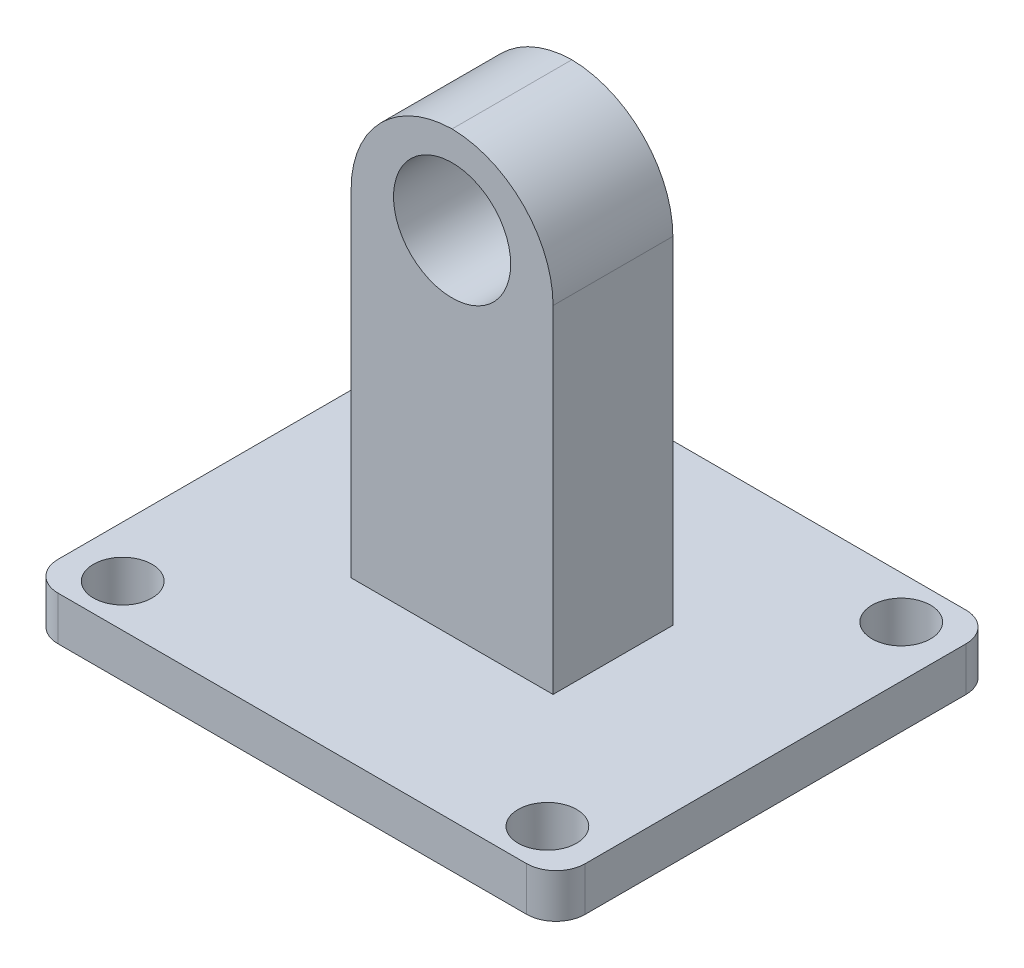
ISO-10303-21;
HEADER;
FILE_DESCRIPTION(('STEP AP214'),'2;1');
FILE_NAME('part.step','',(''),(''),'','','');
FILE_SCHEMA(('AUTOMOTIVE_DESIGN { 1 0 10303 214 1 1 1 1 }'));
ENDSEC;
DATA;
#1=APPLICATION_CONTEXT('core data for automotive mechanical design processes');
#2=APPLICATION_PROTOCOL_DEFINITION('international standard','automotive_design',2000,#1);
#3=PRODUCT_CONTEXT('',#1,'mechanical');
#4=PRODUCT('Part','Part','',(#3));
#5=PRODUCT_RELATED_PRODUCT_CATEGORY('part','',(#4));
#6=PRODUCT_DEFINITION_FORMATION('','',#4);
#7=PRODUCT_DEFINITION_CONTEXT('part definition',#1,'design');
#8=PRODUCT_DEFINITION('design','',#6,#7);
#9=PRODUCT_DEFINITION_SHAPE('','',#8);
#10=(LENGTH_UNIT() NAMED_UNIT(*) SI_UNIT(.MILLI.,.METRE.));
#11=(NAMED_UNIT(*) PLANE_ANGLE_UNIT() SI_UNIT($,.RADIAN.));
#12=(NAMED_UNIT(*) SI_UNIT($,.STERADIAN.) SOLID_ANGLE_UNIT());
#13=UNCERTAINTY_MEASURE_WITH_UNIT(LENGTH_MEASURE(1.E-05),#10,'distance_accuracy_value','');
#14=(GEOMETRIC_REPRESENTATION_CONTEXT(3) GLOBAL_UNCERTAINTY_ASSIGNED_CONTEXT((#13)) GLOBAL_UNIT_ASSIGNED_CONTEXT((#10,
#11,#12)) REPRESENTATION_CONTEXT('',''));
#15=CARTESIAN_POINT('',(0.,0.,0.));
#16=DIRECTION('',(0.,0.,1.));
#17=DIRECTION('',(1.,0.,0.));
#18=AXIS2_PLACEMENT_3D('',#15,#16,#17);
#19=CARTESIAN_POINT('',(0.,3.,0.));
#20=DIRECTION('',(0.,-1.,0.));
#21=DIRECTION('',(0.,0.,-1.));
#22=AXIS2_PLACEMENT_3D('',#19,#20,#21);
#23=PLANE('',#22);
#24=CARTESIAN_POINT('',(-14.5,3.,-12.0833333333333));
#25=DIRECTION('',(0.,-1.,0.));
#26=DIRECTION('',(0.,0.,-1.));
#27=AXIS2_PLACEMENT_3D('',#24,#25,#26);
#28=CIRCLE('',#27,2.);
#29=CARTESIAN_POINT('',(-14.5,3.,-14.0833333333333));
#30=VERTEX_POINT('',#29);
#31=EDGE_CURVE('E401',#30,#30,#28,.F.);
#32=ORIENTED_EDGE('',*,*,#31,.F.);
#33=EDGE_LOOP('',(#32));
#34=FACE_BOUND('',#33,.T.);
#35=CARTESIAN_POINT('',(-14.5,3.,12.0833333333333));
#36=DIRECTION('',(0.,-1.,0.));
#37=DIRECTION('',(0.,0.,-1.));
#38=AXIS2_PLACEMENT_3D('',#35,#36,#37);
#39=CIRCLE('',#38,2.);
#40=CARTESIAN_POINT('',(-14.5,3.,10.0833333333333));
#41=VERTEX_POINT('',#40);
#42=EDGE_CURVE('E405',#41,#41,#39,.F.);
#43=ORIENTED_EDGE('',*,*,#42,.F.);
#44=EDGE_LOOP('',(#43));
#45=FACE_BOUND('',#44,.T.);
#46=CARTESIAN_POINT('',(14.5,3.,12.0833333333333));
#47=DIRECTION('',(0.,-1.,0.));
#48=DIRECTION('',(0.,0.,-1.));
#49=AXIS2_PLACEMENT_3D('',#46,#47,#48);
#50=CIRCLE('',#49,2.);
#51=CARTESIAN_POINT('',(14.5,3.,10.0833333333333));
#52=VERTEX_POINT('',#51);
#53=EDGE_CURVE('E414',#52,#52,#50,.F.);
#54=ORIENTED_EDGE('',*,*,#53,.F.);
#55=EDGE_LOOP('',(#54));
#56=FACE_BOUND('',#55,.T.);
#57=CARTESIAN_POINT('',(14.5,3.,-12.0833333333333));
#58=DIRECTION('',(0.,-1.,0.));
#59=DIRECTION('',(0.,0.,-1.));
#60=AXIS2_PLACEMENT_3D('',#57,#58,#59);
#61=CIRCLE('',#60,2.);
#62=CARTESIAN_POINT('',(14.5,3.,-14.0833333333333));
#63=VERTEX_POINT('',#62);
#64=EDGE_CURVE('E237',#63,#63,#61,.F.);
#65=ORIENTED_EDGE('',*,*,#64,.F.);
#66=EDGE_LOOP('',(#65));
#67=FACE_BOUND('',#66,.T.);
#68=DIRECTION('',(0.,0.,-1.));
#69=VECTOR('',#68,1.);
#70=CARTESIAN_POINT('',(-18.,3.,15.));
#71=LINE('',#70,#69);
#72=CARTESIAN_POINT('',(-18.,3.,13.));
#73=VERTEX_POINT('',#72);
#74=CARTESIAN_POINT('',(-18.,3.,-13.));
#75=VERTEX_POINT('',#74);
#76=EDGE_CURVE('E155',#73,#75,#71,.T.);
#77=ORIENTED_EDGE('',*,*,#76,.F.);
#78=CARTESIAN_POINT('',(-16.,3.,13.));
#79=DIRECTION('',(0.,-1.,0.));
#80=DIRECTION('',(0.,0.,-1.));
#81=AXIS2_PLACEMENT_3D('',#78,#79,#80);
#82=CIRCLE('',#81,2.);
#83=CARTESIAN_POINT('',(-16.,3.,15.));
#84=VERTEX_POINT('',#83);
#85=EDGE_CURVE('E202',#73,#84,#82,.F.);
#86=ORIENTED_EDGE('',*,*,#85,.T.);
#87=DIRECTION('',(1.,0.,0.));
#88=VECTOR('',#87,1.);
#89=CARTESIAN_POINT('',(-18.,3.,15.));
#90=LINE('',#89,#88);
#91=CARTESIAN_POINT('',(16.,3.,15.));
#92=VERTEX_POINT('',#91);
#93=EDGE_CURVE('E165',#84,#92,#90,.T.);
#94=ORIENTED_EDGE('',*,*,#93,.T.);
#95=CARTESIAN_POINT('',(16.,3.,13.));
#96=DIRECTION('',(0.,-1.,0.));
#97=DIRECTION('',(0.,0.,-1.));
#98=AXIS2_PLACEMENT_3D('',#95,#96,#97);
#99=CIRCLE('',#98,2.);
#100=CARTESIAN_POINT('',(18.,3.,13.));
#101=VERTEX_POINT('',#100);
#102=EDGE_CURVE('E196',#92,#101,#99,.F.);
#103=ORIENTED_EDGE('',*,*,#102,.T.);
#104=DIRECTION('',(0.,0.,-1.));
#105=VECTOR('',#104,1.);
#106=CARTESIAN_POINT('',(18.,3.,15.));
#107=LINE('',#106,#105);
#108=CARTESIAN_POINT('',(18.,3.,-13.));
#109=VERTEX_POINT('',#108);
#110=EDGE_CURVE('E162',#101,#109,#107,.T.);
#111=ORIENTED_EDGE('',*,*,#110,.T.);
#112=CARTESIAN_POINT('',(16.,3.,-13.));
#113=DIRECTION('',(0.,-1.,0.));
#114=DIRECTION('',(0.,0.,-1.));
#115=AXIS2_PLACEMENT_3D('',#112,#113,#114);
#116=CIRCLE('',#115,2.);
#117=CARTESIAN_POINT('',(16.,3.,-15.));
#118=VERTEX_POINT('',#117);
#119=EDGE_CURVE('E198',#109,#118,#116,.F.);
#120=ORIENTED_EDGE('',*,*,#119,.T.);
#121=DIRECTION('',(1.,0.,0.));
#122=VECTOR('',#121,1.);
#123=CARTESIAN_POINT('',(-18.,3.,-15.));
#124=LINE('',#123,#122);
#125=CARTESIAN_POINT('',(-16.,3.,-15.));
#126=VERTEX_POINT('',#125);
#127=EDGE_CURVE('E158',#126,#118,#124,.T.);
#128=ORIENTED_EDGE('',*,*,#127,.F.);
#129=CARTESIAN_POINT('',(-16.,3.,-13.));
#130=DIRECTION('',(0.,-1.,0.));
#131=DIRECTION('',(0.,0.,-1.));
#132=AXIS2_PLACEMENT_3D('',#129,#130,#131);
#133=CIRCLE('',#132,2.);
#134=EDGE_CURVE('E200',#126,#75,#133,.F.);
#135=ORIENTED_EDGE('',*,*,#134,.T.);
#136=EDGE_LOOP('',(#77,#86,#94,#103,#111,#120,#128,#135));
#137=FACE_BOUND('',#136,.T.);
#138=DIRECTION('',(0.,0.,-1.));
#139=VECTOR('',#138,1.);
#140=CARTESIAN_POINT('',(6.89465133886415,3.,4.09048344357987));
#141=LINE('',#140,#139);
#142=CARTESIAN_POINT('',(6.89465133886415,3.,4.09048344357987));
#143=VERTEX_POINT('',#142);
#144=CARTESIAN_POINT('',(6.89465133886415,3.,-4.09048344357987));
#145=VERTEX_POINT('',#144);
#146=EDGE_CURVE('E128',#143,#145,#141,.T.);
#147=ORIENTED_EDGE('',*,*,#146,.F.);
#148=DIRECTION('',(1.,0.,0.));
#149=VECTOR('',#148,1.);
#150=CARTESIAN_POINT('',(-6.89465133886415,3.,4.09048344357987));
#151=LINE('',#150,#149);
#152=CARTESIAN_POINT('',(-6.89465133886415,3.,4.09048344357987));
#153=VERTEX_POINT('',#152);
#154=EDGE_CURVE('E133',#153,#143,#151,.T.);
#155=ORIENTED_EDGE('',*,*,#154,.F.);
#156=DIRECTION('',(0.,0.,1.));
#157=VECTOR('',#156,1.);
#158=CARTESIAN_POINT('',(-6.89465133886415,3.,4.09048344357987));
#159=LINE('',#158,#157);
#160=CARTESIAN_POINT('',(-6.89465133886415,3.,-4.09048344357987));
#161=VERTEX_POINT('',#160);
#162=EDGE_CURVE('E144',#161,#153,#159,.T.);
#163=ORIENTED_EDGE('',*,*,#162,.F.);
#164=DIRECTION('',(-1.,0.,0.));
#165=VECTOR('',#164,1.);
#166=CARTESIAN_POINT('',(-6.89465133886415,3.,-4.09048344357987));
#167=LINE('',#166,#165);
#168=EDGE_CURVE('E141',#145,#161,#167,.T.);
#169=ORIENTED_EDGE('',*,*,#168,.F.);
#170=EDGE_LOOP('',(#147,#155,#163,#169));
#171=FACE_BOUND('',#170,.T.);
#172=ADVANCED_FACE('F32',(#34,#45,#56,#67,#137,#171),#23,.F.);
#173=CARTESIAN_POINT('',(-18.,3.,15.));
#174=DIRECTION('',(-1.,0.,0.));
#175=DIRECTION('',(0.,0.,1.));
#176=AXIS2_PLACEMENT_3D('',#173,#174,#175);
#177=PLANE('',#176);
#178=DIRECTION('',(0.,0.,-1.));
#179=VECTOR('',#178,1.);
#180=CARTESIAN_POINT('',(-18.,0.,15.));
#181=LINE('',#180,#179);
#182=CARTESIAN_POINT('',(-18.,0.,13.));
#183=VERTEX_POINT('',#182);
#184=CARTESIAN_POINT('',(-18.,0.,-13.));
#185=VERTEX_POINT('',#184);
#186=EDGE_CURVE('E154',#183,#185,#181,.T.);
#187=ORIENTED_EDGE('',*,*,#186,.F.);
#188=DIRECTION('',(0.,-1.,0.));
#189=VECTOR('',#188,1.);
#190=CARTESIAN_POINT('',(-18.,3.,13.));
#191=LINE('',#190,#189);
#192=EDGE_CURVE('E194',#183,#73,#191,.F.);
#193=ORIENTED_EDGE('',*,*,#192,.T.);
#194=ORIENTED_EDGE('',*,*,#76,.T.);
#195=DIRECTION('',(0.,-1.,0.));
#196=VECTOR('',#195,1.);
#197=CARTESIAN_POINT('',(-18.,3.,-13.));
#198=LINE('',#197,#196);
#199=EDGE_CURVE('E191',#75,#185,#198,.T.);
#200=ORIENTED_EDGE('',*,*,#199,.T.);
#201=EDGE_LOOP('',(#187,#193,#194,#200));
#202=FACE_BOUND('',#201,.T.);
#203=ADVANCED_FACE('F254',(#202),#177,.T.);
#204=CARTESIAN_POINT('',(-18.,3.,15.));
#205=DIRECTION('',(0.,0.,-1.));
#206=DIRECTION('',(-1.,0.,0.));
#207=AXIS2_PLACEMENT_3D('',#204,#205,#206);
#208=PLANE('',#207);
#209=ORIENTED_EDGE('',*,*,#93,.F.);
#210=DIRECTION('',(0.,-1.,0.));
#211=VECTOR('',#210,1.);
#212=CARTESIAN_POINT('',(-16.,0.,15.));
#213=LINE('',#212,#211);
#214=CARTESIAN_POINT('',(-16.,0.,15.));
#215=VERTEX_POINT('',#214);
#216=EDGE_CURVE('E180',#84,#215,#213,.T.);
#217=ORIENTED_EDGE('',*,*,#216,.T.);
#218=DIRECTION('',(1.,0.,0.));
#219=VECTOR('',#218,1.);
#220=CARTESIAN_POINT('',(-18.,0.,15.));
#221=LINE('',#220,#219);
#222=CARTESIAN_POINT('',(16.,0.,15.));
#223=VERTEX_POINT('',#222);
#224=EDGE_CURVE('E159',#215,#223,#221,.T.);
#225=ORIENTED_EDGE('',*,*,#224,.T.);
#226=DIRECTION('',(0.,-1.,0.));
#227=VECTOR('',#226,1.);
#228=CARTESIAN_POINT('',(16.,3.,15.));
#229=LINE('',#228,#227);
#230=EDGE_CURVE('E168',#223,#92,#229,.F.);
#231=ORIENTED_EDGE('',*,*,#230,.T.);
#232=EDGE_LOOP('',(#209,#217,#225,#231));
#233=FACE_BOUND('',#232,.T.);
#234=ADVANCED_FACE('F260',(#233),#208,.F.);
#235=CARTESIAN_POINT('',(18.,3.,15.));
#236=DIRECTION('',(-1.,0.,0.));
#237=DIRECTION('',(0.,0.,1.));
#238=AXIS2_PLACEMENT_3D('',#235,#236,#237);
#239=PLANE('',#238);
#240=DIRECTION('',(0.,0.,-1.));
#241=VECTOR('',#240,1.);
#242=CARTESIAN_POINT('',(18.,0.,15.));
#243=LINE('',#242,#241);
#244=CARTESIAN_POINT('',(18.,0.,13.));
#245=VERTEX_POINT('',#244);
#246=CARTESIAN_POINT('',(18.,0.,-13.));
#247=VERTEX_POINT('',#246);
#248=EDGE_CURVE('E174',#245,#247,#243,.T.);
#249=ORIENTED_EDGE('',*,*,#248,.T.);
#250=DIRECTION('',(0.,-1.,0.));
#251=VECTOR('',#250,1.);
#252=CARTESIAN_POINT('',(18.,3.,-13.));
#253=LINE('',#252,#251);
#254=EDGE_CURVE('E212',#247,#109,#253,.F.);
#255=ORIENTED_EDGE('',*,*,#254,.T.);
#256=ORIENTED_EDGE('',*,*,#110,.F.);
#257=DIRECTION('',(0.,-1.,0.));
#258=VECTOR('',#257,1.);
#259=CARTESIAN_POINT('',(18.,3.,13.));
#260=LINE('',#259,#258);
#261=EDGE_CURVE('E209',#101,#245,#260,.T.);
#262=ORIENTED_EDGE('',*,*,#261,.T.);
#263=EDGE_LOOP('',(#249,#255,#256,#262));
#264=FACE_BOUND('',#263,.T.);
#265=ADVANCED_FACE('F274',(#264),#239,.F.);
#266=CARTESIAN_POINT('',(-18.,3.,-15.));
#267=DIRECTION('',(0.,0.,-1.));
#268=DIRECTION('',(-1.,0.,0.));
#269=AXIS2_PLACEMENT_3D('',#266,#267,#268);
#270=PLANE('',#269);
#271=DIRECTION('',(1.,0.,0.));
#272=VECTOR('',#271,1.);
#273=CARTESIAN_POINT('',(-18.,0.,-15.));
#274=LINE('',#273,#272);
#275=CARTESIAN_POINT('',(-16.,0.,-15.));
#276=VERTEX_POINT('',#275);
#277=CARTESIAN_POINT('',(16.,0.,-15.));
#278=VERTEX_POINT('',#277);
#279=EDGE_CURVE('E171',#276,#278,#274,.T.);
#280=ORIENTED_EDGE('',*,*,#279,.F.);
#281=DIRECTION('',(0.,-1.,0.));
#282=VECTOR('',#281,1.);
#283=CARTESIAN_POINT('',(-16.,3.,-15.));
#284=LINE('',#283,#282);
#285=EDGE_CURVE('E207',#276,#126,#284,.F.);
#286=ORIENTED_EDGE('',*,*,#285,.T.);
#287=ORIENTED_EDGE('',*,*,#127,.T.);
#288=DIRECTION('',(0.,-1.,0.));
#289=VECTOR('',#288,1.);
#290=CARTESIAN_POINT('',(16.,0.,-15.));
#291=LINE('',#290,#289);
#292=EDGE_CURVE('E204',#118,#278,#291,.T.);
#293=ORIENTED_EDGE('',*,*,#292,.T.);
#294=EDGE_LOOP('',(#280,#286,#287,#293));
#295=FACE_BOUND('',#294,.T.);
#296=ADVANCED_FACE('F270',(#295),#270,.T.);
#297=CARTESIAN_POINT('',(0.,0.,0.));
#298=DIRECTION('',(0.,-1.,0.));
#299=DIRECTION('',(0.,0.,-1.));
#300=AXIS2_PLACEMENT_3D('',#297,#298,#299);
#301=PLANE('',#300);
#302=CARTESIAN_POINT('',(-14.5,0.,-12.0833333333333));
#303=DIRECTION('',(0.,1.,0.));
#304=DIRECTION('',(0.,0.,1.));
#305=AXIS2_PLACEMENT_3D('',#302,#303,#304);
#306=CIRCLE('',#305,2.);
#307=CARTESIAN_POINT('',(-14.5,0.,-10.0833333333333));
#308=VERTEX_POINT('',#307);
#309=EDGE_CURVE('E399',#308,#308,#306,.T.);
#310=ORIENTED_EDGE('',*,*,#309,.T.);
#311=EDGE_LOOP('',(#310));
#312=FACE_BOUND('',#311,.T.);
#313=CARTESIAN_POINT('',(-14.5,0.,12.0833333333333));
#314=DIRECTION('',(0.,1.,0.));
#315=DIRECTION('',(0.,0.,1.));
#316=AXIS2_PLACEMENT_3D('',#313,#314,#315);
#317=CIRCLE('',#316,2.);
#318=CARTESIAN_POINT('',(-14.5,0.,14.0833333333333));
#319=VERTEX_POINT('',#318);
#320=EDGE_CURVE('E402',#319,#319,#317,.T.);
#321=ORIENTED_EDGE('',*,*,#320,.T.);
#322=EDGE_LOOP('',(#321));
#323=FACE_BOUND('',#322,.T.);
#324=CARTESIAN_POINT('',(14.5,0.,12.0833333333333));
#325=DIRECTION('',(0.,1.,0.));
#326=DIRECTION('',(0.,0.,1.));
#327=AXIS2_PLACEMENT_3D('',#324,#325,#326);
#328=CIRCLE('',#327,2.);
#329=CARTESIAN_POINT('',(14.5,0.,14.0833333333333));
#330=VERTEX_POINT('',#329);
#331=EDGE_CURVE('E411',#330,#330,#328,.T.);
#332=ORIENTED_EDGE('',*,*,#331,.T.);
#333=EDGE_LOOP('',(#332));
#334=FACE_BOUND('',#333,.T.);
#335=CARTESIAN_POINT('',(14.5,0.,-12.0833333333333));
#336=DIRECTION('',(0.,1.,0.));
#337=DIRECTION('',(0.,0.,1.));
#338=AXIS2_PLACEMENT_3D('',#335,#336,#337);
#339=CIRCLE('',#338,2.);
#340=CARTESIAN_POINT('',(14.5,0.,-10.0833333333333));
#341=VERTEX_POINT('',#340);
#342=EDGE_CURVE('E417',#341,#341,#339,.T.);
#343=ORIENTED_EDGE('',*,*,#342,.T.);
#344=EDGE_LOOP('',(#343));
#345=FACE_BOUND('',#344,.T.);
#346=ORIENTED_EDGE('',*,*,#224,.F.);
#347=CARTESIAN_POINT('',(-16.,0.,13.));
#348=DIRECTION('',(0.,-1.,0.));
#349=DIRECTION('',(0.,0.,-1.));
#350=AXIS2_PLACEMENT_3D('',#347,#348,#349);
#351=CIRCLE('',#350,2.);
#352=EDGE_CURVE('E189',#215,#183,#351,.T.);
#353=ORIENTED_EDGE('',*,*,#352,.T.);
#354=ORIENTED_EDGE('',*,*,#186,.T.);
#355=CARTESIAN_POINT('',(-16.,0.,-13.));
#356=DIRECTION('',(0.,-1.,0.));
#357=DIRECTION('',(0.,0.,-1.));
#358=AXIS2_PLACEMENT_3D('',#355,#356,#357);
#359=CIRCLE('',#358,2.);
#360=EDGE_CURVE('E187',#185,#276,#359,.T.);
#361=ORIENTED_EDGE('',*,*,#360,.T.);
#362=ORIENTED_EDGE('',*,*,#279,.T.);
#363=CARTESIAN_POINT('',(16.,0.,-13.));
#364=DIRECTION('',(0.,-1.,0.));
#365=DIRECTION('',(0.,0.,-1.));
#366=AXIS2_PLACEMENT_3D('',#363,#364,#365);
#367=CIRCLE('',#366,2.);
#368=EDGE_CURVE('E185',#278,#247,#367,.T.);
#369=ORIENTED_EDGE('',*,*,#368,.T.);
#370=ORIENTED_EDGE('',*,*,#248,.F.);
#371=CARTESIAN_POINT('',(16.,0.,13.));
#372=DIRECTION('',(0.,-1.,0.));
#373=DIRECTION('',(0.,0.,-1.));
#374=AXIS2_PLACEMENT_3D('',#371,#372,#373);
#375=CIRCLE('',#374,2.);
#376=EDGE_CURVE('E183',#245,#223,#375,.T.);
#377=ORIENTED_EDGE('',*,*,#376,.T.);
#378=EDGE_LOOP('',(#346,#353,#354,#361,#362,#369,#370,#377));
#379=FACE_BOUND('',#378,.T.);
#380=ADVANCED_FACE('F267',(#312,#323,#334,#345,#379),#301,.T.);
#381=CARTESIAN_POINT('',(6.89465133886415,33.,4.09048344357987));
#382=DIRECTION('',(-1.,0.,0.));
#383=DIRECTION('',(0.,0.,1.));
#384=AXIS2_PLACEMENT_3D('',#381,#382,#383);
#385=PLANE('',#384);
#386=DIRECTION('',(0.,-1.,0.));
#387=VECTOR('',#386,1.);
#388=CARTESIAN_POINT('',(6.89465133886415,33.,-4.09048344357987));
#389=LINE('',#388,#387);
#390=CARTESIAN_POINT('',(6.89465133886415,26.,-4.09048344357987));
#391=VERTEX_POINT('',#390);
#392=EDGE_CURVE('E152',#391,#145,#389,.T.);
#393=ORIENTED_EDGE('',*,*,#392,.F.);
#394=DIRECTION('',(0.,0.,-1.));
#395=VECTOR('',#394,1.);
#396=CARTESIAN_POINT('',(6.89465133886415,26.,4.09048344357987));
#397=LINE('',#396,#395);
#398=CARTESIAN_POINT('',(6.89465133886415,26.,4.09048344357987));
#399=VERTEX_POINT('',#398);
#400=EDGE_CURVE('E130',#391,#399,#397,.F.);
#401=ORIENTED_EDGE('',*,*,#400,.T.);
#402=DIRECTION('',(0.,-1.,0.));
#403=VECTOR('',#402,1.);
#404=CARTESIAN_POINT('',(6.89465133886415,33.,4.09048344357987));
#405=LINE('',#404,#403);
#406=EDGE_CURVE('E124',#399,#143,#405,.T.);
#407=ORIENTED_EDGE('',*,*,#406,.T.);
#408=ORIENTED_EDGE('',*,*,#146,.T.);
#409=EDGE_LOOP('',(#393,#401,#407,#408));
#410=FACE_BOUND('',#409,.T.);
#411=ADVANCED_FACE('F127',(#410),#385,.F.);
#412=CARTESIAN_POINT('',(-6.89465133886415,33.,-4.09048344357987));
#413=DIRECTION('',(0.,0.,1.));
#414=DIRECTION('',(1.,0.,0.));
#415=AXIS2_PLACEMENT_3D('',#412,#413,#414);
#416=PLANE('',#415);
#417=CARTESIAN_POINT('',(0.,27.,-4.09048344357987));
#418=DIRECTION('',(0.,0.,1.));
#419=DIRECTION('',(1.,0.,0.));
#420=AXIS2_PLACEMENT_3D('',#417,#418,#419);
#421=CIRCLE('',#420,4.);
#422=CARTESIAN_POINT('',(4.,27.,-4.09048344357987));
#423=VERTEX_POINT('',#422);
#424=EDGE_CURVE('E230',#423,#423,#421,.T.);
#425=ORIENTED_EDGE('',*,*,#424,.T.);
#426=EDGE_LOOP('',(#425));
#427=FACE_BOUND('',#426,.T.);
#428=CARTESIAN_POINT('',(0.105348661135846,26.,-4.09048344357987));
#429=DIRECTION('',(0.,0.,1.));
#430=DIRECTION('',(1.,0.,0.));
#431=AXIS2_PLACEMENT_3D('',#428,#429,#430);
#432=CIRCLE('',#431,7.);
#433=CARTESIAN_POINT('',(-6.89465133886415,26.,-4.09048344357987));
#434=VERTEX_POINT('',#433);
#435=CARTESIAN_POINT('',(0.,32.9992072165065,-4.09048344357987));
#436=VERTEX_POINT('',#435);
#437=EDGE_CURVE('E214',#434,#436,#432,.F.);
#438=ORIENTED_EDGE('',*,*,#437,.T.);
#439=CARTESIAN_POINT('',(-0.105348661135846,26.,-4.09048344357987));
#440=DIRECTION('',(0.,0.,1.));
#441=DIRECTION('',(1.,0.,0.));
#442=AXIS2_PLACEMENT_3D('',#439,#440,#441);
#443=CIRCLE('',#442,7.);
#444=EDGE_CURVE('E216',#436,#391,#443,.F.);
#445=ORIENTED_EDGE('',*,*,#444,.T.);
#446=ORIENTED_EDGE('',*,*,#392,.T.);
#447=ORIENTED_EDGE('',*,*,#168,.T.);
#448=DIRECTION('',(0.,-1.,0.));
#449=VECTOR('',#448,1.);
#450=CARTESIAN_POINT('',(-6.89465133886415,33.,-4.09048344357987));
#451=LINE('',#450,#449);
#452=EDGE_CURVE('E150',#434,#161,#451,.T.);
#453=ORIENTED_EDGE('',*,*,#452,.F.);
#454=EDGE_LOOP('',(#438,#445,#446,#447,#453));
#455=FACE_BOUND('',#454,.T.);
#456=ADVANCED_FACE('F222',(#427,#455),#416,.F.);
#457=CARTESIAN_POINT('',(-6.89465133886415,33.,4.09048344357987));
#458=DIRECTION('',(1.,0.,0.));
#459=DIRECTION('',(0.,0.,-1.));
#460=AXIS2_PLACEMENT_3D('',#457,#458,#459);
#461=PLANE('',#460);
#462=DIRECTION('',(0.,-1.,0.));
#463=VECTOR('',#462,1.);
#464=CARTESIAN_POINT('',(-6.89465133886415,33.,4.09048344357987));
#465=LINE('',#464,#463);
#466=CARTESIAN_POINT('',(-6.89465133886415,26.,4.09048344357987));
#467=VERTEX_POINT('',#466);
#468=EDGE_CURVE('E132',#467,#153,#465,.T.);
#469=ORIENTED_EDGE('',*,*,#468,.F.);
#470=DIRECTION('',(0.,0.,1.));
#471=VECTOR('',#470,1.);
#472=CARTESIAN_POINT('',(-6.89465133886415,26.,4.09048344357987));
#473=LINE('',#472,#471);
#474=EDGE_CURVE('E11',#467,#434,#473,.F.);
#475=ORIENTED_EDGE('',*,*,#474,.T.);
#476=ORIENTED_EDGE('',*,*,#452,.T.);
#477=ORIENTED_EDGE('',*,*,#162,.T.);
#478=EDGE_LOOP('',(#469,#475,#476,#477));
#479=FACE_BOUND('',#478,.T.);
#480=ADVANCED_FACE('F242',(#479),#461,.F.);
#481=CARTESIAN_POINT('',(-6.89465133886415,33.,4.09048344357987));
#482=DIRECTION('',(0.,0.,-1.));
#483=DIRECTION('',(-1.,0.,0.));
#484=AXIS2_PLACEMENT_3D('',#481,#482,#483);
#485=PLANE('',#484);
#486=CARTESIAN_POINT('',(0.,27.,4.09048344357987));
#487=DIRECTION('',(0.,0.,1.));
#488=DIRECTION('',(1.,0.,0.));
#489=AXIS2_PLACEMENT_3D('',#486,#487,#488);
#490=CIRCLE('',#489,4.);
#491=CARTESIAN_POINT('',(4.,27.,4.09048344357987));
#492=VERTEX_POINT('',#491);
#493=EDGE_CURVE('E232',#492,#492,#490,.T.);
#494=ORIENTED_EDGE('',*,*,#493,.F.);
#495=EDGE_LOOP('',(#494));
#496=FACE_BOUND('',#495,.T.);
#497=ORIENTED_EDGE('',*,*,#406,.F.);
#498=CARTESIAN_POINT('',(-0.105348661135846,26.,4.09048344357987));
#499=DIRECTION('',(0.,0.,-1.));
#500=DIRECTION('',(-1.,0.,0.));
#501=AXIS2_PLACEMENT_3D('',#498,#499,#500);
#502=CIRCLE('',#501,7.);
#503=CARTESIAN_POINT('',(0.,32.9992072165065,4.09048344357987));
#504=VERTEX_POINT('',#503);
#505=EDGE_CURVE('E41',#399,#504,#502,.F.);
#506=ORIENTED_EDGE('',*,*,#505,.T.);
#507=CARTESIAN_POINT('',(0.105348661135846,26.,4.09048344357987));
#508=DIRECTION('',(0.,0.,-1.));
#509=DIRECTION('',(-1.,0.,0.));
#510=AXIS2_PLACEMENT_3D('',#507,#508,#509);
#511=CIRCLE('',#510,7.);
#512=EDGE_CURVE('E51',#504,#467,#511,.F.);
#513=ORIENTED_EDGE('',*,*,#512,.T.);
#514=ORIENTED_EDGE('',*,*,#468,.T.);
#515=ORIENTED_EDGE('',*,*,#154,.T.);
#516=EDGE_LOOP('',(#497,#506,#513,#514,#515));
#517=FACE_BOUND('',#516,.T.);
#518=ADVANCED_FACE('F143',(#496,#517),#485,.F.);
#519=CARTESIAN_POINT('',(-16.,3.,13.));
#520=DIRECTION('',(0.,1.,0.));
#521=DIRECTION('',(0.,0.,1.));
#522=AXIS2_PLACEMENT_3D('',#519,#520,#521);
#523=CYLINDRICAL_SURFACE('',#522,2.);
#524=ORIENTED_EDGE('',*,*,#85,.F.);
#525=ORIENTED_EDGE('',*,*,#192,.F.);
#526=ORIENTED_EDGE('',*,*,#352,.F.);
#527=ORIENTED_EDGE('',*,*,#216,.F.);
#528=EDGE_LOOP('',(#524,#525,#526,#527));
#529=FACE_BOUND('',#528,.T.);
#530=ADVANCED_FACE('F249',(#529),#523,.T.);
#531=CARTESIAN_POINT('',(-16.,3.,-13.));
#532=DIRECTION('',(0.,-1.,0.));
#533=DIRECTION('',(0.,0.,-1.));
#534=AXIS2_PLACEMENT_3D('',#531,#532,#533);
#535=CYLINDRICAL_SURFACE('',#534,2.);
#536=ORIENTED_EDGE('',*,*,#134,.F.);
#537=ORIENTED_EDGE('',*,*,#285,.F.);
#538=ORIENTED_EDGE('',*,*,#360,.F.);
#539=ORIENTED_EDGE('',*,*,#199,.F.);
#540=EDGE_LOOP('',(#536,#537,#538,#539));
#541=FACE_BOUND('',#540,.T.);
#542=ADVANCED_FACE('F284',(#541),#535,.T.);
#543=CARTESIAN_POINT('',(16.,3.,-13.));
#544=DIRECTION('',(0.,1.,0.));
#545=DIRECTION('',(0.,0.,1.));
#546=AXIS2_PLACEMENT_3D('',#543,#544,#545);
#547=CYLINDRICAL_SURFACE('',#546,2.);
#548=ORIENTED_EDGE('',*,*,#119,.F.);
#549=ORIENTED_EDGE('',*,*,#254,.F.);
#550=ORIENTED_EDGE('',*,*,#368,.F.);
#551=ORIENTED_EDGE('',*,*,#292,.F.);
#552=EDGE_LOOP('',(#548,#549,#550,#551));
#553=FACE_BOUND('',#552,.T.);
#554=ADVANCED_FACE('F288',(#553),#547,.T.);
#555=CARTESIAN_POINT('',(16.,3.,13.));
#556=DIRECTION('',(0.,-1.,0.));
#557=DIRECTION('',(0.,0.,-1.));
#558=AXIS2_PLACEMENT_3D('',#555,#556,#557);
#559=CYLINDRICAL_SURFACE('',#558,2.);
#560=ORIENTED_EDGE('',*,*,#102,.F.);
#561=ORIENTED_EDGE('',*,*,#230,.F.);
#562=ORIENTED_EDGE('',*,*,#376,.F.);
#563=ORIENTED_EDGE('',*,*,#261,.F.);
#564=EDGE_LOOP('',(#560,#561,#562,#563));
#565=FACE_BOUND('',#564,.T.);
#566=ADVANCED_FACE('F292',(#565),#559,.T.);
#567=CARTESIAN_POINT('',(0.105348661135846,26.,0.));
#568=DIRECTION('',(0.,0.,1.));
#569=DIRECTION('',(1.,0.,0.));
#570=AXIS2_PLACEMENT_3D('',#567,#568,#569);
#571=CYLINDRICAL_SURFACE('',#570,7.);
#572=ORIENTED_EDGE('',*,*,#474,.F.);
#573=ORIENTED_EDGE('',*,*,#512,.F.);
#574=DIRECTION('',(0.,0.,1.));
#575=VECTOR('',#574,1.);
#576=CARTESIAN_POINT('',(0.,32.9992072165065,0.));
#577=LINE('',#576,#575);
#578=EDGE_CURVE('E36',#436,#504,#577,.T.);
#579=ORIENTED_EDGE('',*,*,#578,.F.);
#580=ORIENTED_EDGE('',*,*,#437,.F.);
#581=EDGE_LOOP('',(#572,#573,#579,#580));
#582=FACE_BOUND('',#581,.T.);
#583=ADVANCED_FACE('F34',(#582),#571,.T.);
#584=CARTESIAN_POINT('',(-0.105348661135846,26.,0.));
#585=DIRECTION('',(0.,0.,-1.));
#586=DIRECTION('',(-1.,0.,0.));
#587=AXIS2_PLACEMENT_3D('',#584,#585,#586);
#588=CYLINDRICAL_SURFACE('',#587,7.);
#589=ORIENTED_EDGE('',*,*,#505,.F.);
#590=ORIENTED_EDGE('',*,*,#400,.F.);
#591=ORIENTED_EDGE('',*,*,#444,.F.);
#592=ORIENTED_EDGE('',*,*,#578,.T.);
#593=EDGE_LOOP('',(#589,#590,#591,#592));
#594=FACE_BOUND('',#593,.T.);
#595=ADVANCED_FACE('F228',(#594),#588,.T.);
#596=CARTESIAN_POINT('',(0.,27.,-8.90951655642013));
#597=DIRECTION('',(0.,0.,1.));
#598=DIRECTION('',(1.,0.,0.));
#599=AXIS2_PLACEMENT_3D('',#596,#597,#598);
#600=CYLINDRICAL_SURFACE('',#599,4.);
#601=ORIENTED_EDGE('',*,*,#493,.T.);
#602=EDGE_LOOP('',(#601));
#603=FACE_BOUND('',#602,.T.);
#604=ORIENTED_EDGE('',*,*,#424,.F.);
#605=EDGE_LOOP('',(#604));
#606=FACE_BOUND('',#605,.T.);
#607=ADVANCED_FACE('F297',(#603,#606),#600,.F.);
#608=CARTESIAN_POINT('',(14.5,4.,-12.0833333333333));
#609=DIRECTION('',(0.,-1.,0.));
#610=DIRECTION('',(0.,0.,-1.));
#611=AXIS2_PLACEMENT_3D('',#608,#609,#610);
#612=CYLINDRICAL_SURFACE('',#611,2.);
#613=ORIENTED_EDGE('',*,*,#342,.F.);
#614=EDGE_LOOP('',(#613));
#615=FACE_BOUND('',#614,.T.);
#616=ORIENTED_EDGE('',*,*,#64,.T.);
#617=EDGE_LOOP('',(#616));
#618=FACE_BOUND('',#617,.T.);
#619=ADVANCED_FACE('F302',(#615,#618),#612,.F.);
#620=CARTESIAN_POINT('',(14.5,4.,12.0833333333333));
#621=DIRECTION('',(0.,-1.,0.));
#622=DIRECTION('',(0.,0.,-1.));
#623=AXIS2_PLACEMENT_3D('',#620,#621,#622);
#624=CYLINDRICAL_SURFACE('',#623,2.);
#625=ORIENTED_EDGE('',*,*,#331,.F.);
#626=EDGE_LOOP('',(#625));
#627=FACE_BOUND('',#626,.T.);
#628=ORIENTED_EDGE('',*,*,#53,.T.);
#629=EDGE_LOOP('',(#628));
#630=FACE_BOUND('',#629,.T.);
#631=ADVANCED_FACE('F362',(#627,#630),#624,.F.);
#632=CARTESIAN_POINT('',(-14.5,4.,12.0833333333333));
#633=DIRECTION('',(0.,-1.,0.));
#634=DIRECTION('',(0.,0.,-1.));
#635=AXIS2_PLACEMENT_3D('',#632,#633,#634);
#636=CYLINDRICAL_SURFACE('',#635,2.);
#637=ORIENTED_EDGE('',*,*,#320,.F.);
#638=EDGE_LOOP('',(#637));
#639=FACE_BOUND('',#638,.T.);
#640=ORIENTED_EDGE('',*,*,#42,.T.);
#641=EDGE_LOOP('',(#640));
#642=FACE_BOUND('',#641,.T.);
#643=ADVANCED_FACE('F372',(#639,#642),#636,.F.);
#644=CARTESIAN_POINT('',(-14.5,4.,-12.0833333333333));
#645=DIRECTION('',(0.,-1.,0.));
#646=DIRECTION('',(0.,0.,-1.));
#647=AXIS2_PLACEMENT_3D('',#644,#645,#646);
#648=CYLINDRICAL_SURFACE('',#647,2.);
#649=ORIENTED_EDGE('',*,*,#309,.F.);
#650=EDGE_LOOP('',(#649));
#651=FACE_BOUND('',#650,.T.);
#652=ORIENTED_EDGE('',*,*,#31,.T.);
#653=EDGE_LOOP('',(#652));
#654=FACE_BOUND('',#653,.T.);
#655=ADVANCED_FACE('F382',(#651,#654),#648,.F.);
#656=CLOSED_SHELL('',(#172,#203,#234,#265,#296,#380,#411,#456,#480,#518,#530,#542,#554,#566,
#583,#595,#607,#619,#631,#643,#655));
#657=MANIFOLD_SOLID_BREP('B2',#656);
#658=ADVANCED_BREP_SHAPE_REPRESENTATION('',(#18,#657),#14);
#659=SHAPE_DEFINITION_REPRESENTATION(#9,#658);
ENDSEC;
END-ISO-10303-21;
